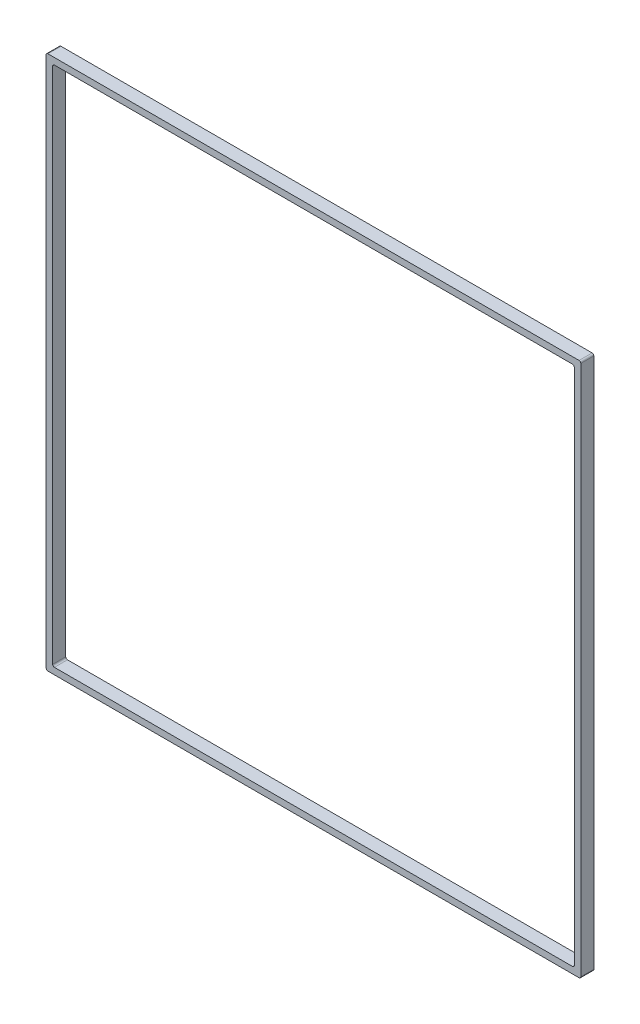
ISO-10303-21;
HEADER;
FILE_DESCRIPTION(('STEP AP214'),'2;1');
FILE_NAME('part.step','',(''),(''),'','','');
FILE_SCHEMA(('AUTOMOTIVE_DESIGN { 1 0 10303 214 1 1 1 1 }'));
ENDSEC;
DATA;
#1=APPLICATION_CONTEXT('core data for automotive mechanical design processes');
#2=APPLICATION_PROTOCOL_DEFINITION('international standard','automotive_design',2000,#1);
#3=PRODUCT_CONTEXT('',#1,'mechanical');
#4=PRODUCT('Part','Part','',(#3));
#5=PRODUCT_RELATED_PRODUCT_CATEGORY('part','',(#4));
#6=PRODUCT_DEFINITION_FORMATION('','',#4);
#7=PRODUCT_DEFINITION_CONTEXT('part definition',#1,'design');
#8=PRODUCT_DEFINITION('design','',#6,#7);
#9=PRODUCT_DEFINITION_SHAPE('','',#8);
#10=(LENGTH_UNIT() NAMED_UNIT(*) SI_UNIT(.MILLI.,.METRE.));
#11=(NAMED_UNIT(*) PLANE_ANGLE_UNIT() SI_UNIT($,.RADIAN.));
#12=(NAMED_UNIT(*) SI_UNIT($,.STERADIAN.) SOLID_ANGLE_UNIT());
#13=UNCERTAINTY_MEASURE_WITH_UNIT(LENGTH_MEASURE(1.E-05),#10,'distance_accuracy_value','');
#14=(GEOMETRIC_REPRESENTATION_CONTEXT(3) GLOBAL_UNCERTAINTY_ASSIGNED_CONTEXT((#13)) GLOBAL_UNIT_ASSIGNED_CONTEXT((#10,
#11,#12)) REPRESENTATION_CONTEXT('',''));
#15=CARTESIAN_POINT('',(0.,0.,0.));
#16=DIRECTION('',(0.,0.,1.));
#17=DIRECTION('',(1.,0.,0.));
#18=AXIS2_PLACEMENT_3D('',#15,#16,#17);
#19=CARTESIAN_POINT('',(390.525,390.525,19.05));
#20=DIRECTION('',(0.,0.,-1.));
#21=DIRECTION('',(-1.,0.,0.));
#22=AXIS2_PLACEMENT_3D('',#19,#20,#21);
#23=PLANE('',#22);
#24=DIRECTION('',(1.,0.,0.));
#25=VECTOR('',#24,1.);
#26=CARTESIAN_POINT('',(-390.525,-390.525,19.05));
#27=LINE('',#26,#25);
#28=CARTESIAN_POINT('',(-387.985,-390.525,19.05));
#29=VERTEX_POINT('',#28);
#30=CARTESIAN_POINT('',(387.985,-390.525,19.05));
#31=VERTEX_POINT('',#30);
#32=EDGE_CURVE('E172',#29,#31,#27,.T.);
#33=ORIENTED_EDGE('',*,*,#32,.T.);
#34=CARTESIAN_POINT('',(387.985,-387.985,19.05));
#35=DIRECTION('',(0.,0.,-1.));
#36=DIRECTION('',(-1.,0.,0.));
#37=AXIS2_PLACEMENT_3D('',#34,#35,#36);
#38=CIRCLE('',#37,2.54);
#39=CARTESIAN_POINT('',(390.525,-387.985,19.05));
#40=VERTEX_POINT('',#39);
#41=EDGE_CURVE('E219',#31,#40,#38,.F.);
#42=ORIENTED_EDGE('',*,*,#41,.T.);
#43=DIRECTION('',(0.,1.,0.));
#44=VECTOR('',#43,1.);
#45=CARTESIAN_POINT('',(390.525,-390.525,19.05));
#46=LINE('',#45,#44);
#47=CARTESIAN_POINT('',(390.525,387.985,19.05));
#48=VERTEX_POINT('',#47);
#49=EDGE_CURVE('E272',#40,#48,#46,.T.);
#50=ORIENTED_EDGE('',*,*,#49,.T.);
#51=CARTESIAN_POINT('',(387.985,387.985,19.05));
#52=DIRECTION('',(0.,0.,-1.));
#53=DIRECTION('',(-1.,0.,0.));
#54=AXIS2_PLACEMENT_3D('',#51,#52,#53);
#55=CIRCLE('',#54,2.54);
#56=CARTESIAN_POINT('',(387.985,390.525,19.05));
#57=VERTEX_POINT('',#56);
#58=EDGE_CURVE('E214',#48,#57,#55,.F.);
#59=ORIENTED_EDGE('',*,*,#58,.T.);
#60=DIRECTION('',(-1.,0.,0.));
#61=VECTOR('',#60,1.);
#62=CARTESIAN_POINT('',(-390.525,390.525,19.05));
#63=LINE('',#62,#61);
#64=CARTESIAN_POINT('',(-387.985,390.525,19.05));
#65=VERTEX_POINT('',#64);
#66=EDGE_CURVE('E275',#57,#65,#63,.T.);
#67=ORIENTED_EDGE('',*,*,#66,.T.);
#68=CARTESIAN_POINT('',(-387.985,387.985,19.05));
#69=DIRECTION('',(0.,0.,-1.));
#70=DIRECTION('',(-1.,0.,0.));
#71=AXIS2_PLACEMENT_3D('',#68,#69,#70);
#72=CIRCLE('',#71,2.54);
#73=CARTESIAN_POINT('',(-390.525,387.985,19.05));
#74=VERTEX_POINT('',#73);
#75=EDGE_CURVE('E54',#65,#74,#72,.F.);
#76=ORIENTED_EDGE('',*,*,#75,.T.);
#77=DIRECTION('',(0.,-1.,0.));
#78=VECTOR('',#77,1.);
#79=CARTESIAN_POINT('',(-390.525,-390.525,19.05));
#80=LINE('',#79,#78);
#81=CARTESIAN_POINT('',(-390.525,-387.985,19.05));
#82=VERTEX_POINT('',#81);
#83=EDGE_CURVE('E177',#74,#82,#80,.T.);
#84=ORIENTED_EDGE('',*,*,#83,.T.);
#85=CARTESIAN_POINT('',(-387.985,-387.985,19.05));
#86=DIRECTION('',(0.,0.,-1.));
#87=DIRECTION('',(-1.,0.,0.));
#88=AXIS2_PLACEMENT_3D('',#85,#86,#87);
#89=CIRCLE('',#88,2.54);
#90=EDGE_CURVE('E217',#82,#29,#89,.F.);
#91=ORIENTED_EDGE('',*,*,#90,.T.);
#92=EDGE_LOOP('',(#33,#42,#50,#59,#67,#76,#84,#91));
#93=FACE_BOUND('',#92,.T.);
#94=DIRECTION('',(0.,1.,0.));
#95=VECTOR('',#94,1.);
#96=CARTESIAN_POINT('',(381.,-381.,19.05));
#97=LINE('',#96,#95);
#98=CARTESIAN_POINT('',(381.,-378.46,19.05));
#99=VERTEX_POINT('',#98);
#100=CARTESIAN_POINT('',(381.,378.46,19.05));
#101=VERTEX_POINT('',#100);
#102=EDGE_CURVE('E261',#99,#101,#97,.T.);
#103=ORIENTED_EDGE('',*,*,#102,.F.);
#104=CARTESIAN_POINT('',(378.46,-378.46,19.05));
#105=DIRECTION('',(0.,0.,-1.));
#106=DIRECTION('',(-1.,0.,0.));
#107=AXIS2_PLACEMENT_3D('',#104,#105,#106);
#108=CIRCLE('',#107,2.54);
#109=CARTESIAN_POINT('',(378.46,-381.,19.05));
#110=VERTEX_POINT('',#109);
#111=EDGE_CURVE('E157',#99,#110,#108,.T.);
#112=ORIENTED_EDGE('',*,*,#111,.T.);
#113=DIRECTION('',(1.,0.,0.));
#114=VECTOR('',#113,1.);
#115=CARTESIAN_POINT('',(-381.,-381.,19.05));
#116=LINE('',#115,#114);
#117=CARTESIAN_POINT('',(-378.46,-381.,19.05));
#118=VERTEX_POINT('',#117);
#119=EDGE_CURVE('E263',#118,#110,#116,.T.);
#120=ORIENTED_EDGE('',*,*,#119,.F.);
#121=CARTESIAN_POINT('',(-378.46,-378.46,19.05));
#122=DIRECTION('',(0.,0.,-1.));
#123=DIRECTION('',(-1.,0.,0.));
#124=AXIS2_PLACEMENT_3D('',#121,#122,#123);
#125=CIRCLE('',#124,2.54);
#126=CARTESIAN_POINT('',(-381.,-378.46,19.05));
#127=VERTEX_POINT('',#126);
#128=EDGE_CURVE('E236',#118,#127,#125,.T.);
#129=ORIENTED_EDGE('',*,*,#128,.T.);
#130=DIRECTION('',(0.,-1.,0.));
#131=VECTOR('',#130,1.);
#132=CARTESIAN_POINT('',(-381.,-381.,19.05));
#133=LINE('',#132,#131);
#134=CARTESIAN_POINT('',(-381.,378.46,19.05));
#135=VERTEX_POINT('',#134);
#136=EDGE_CURVE('E257',#135,#127,#133,.T.);
#137=ORIENTED_EDGE('',*,*,#136,.F.);
#138=CARTESIAN_POINT('',(-378.46,378.46,19.05));
#139=DIRECTION('',(0.,0.,-1.));
#140=DIRECTION('',(-1.,0.,0.));
#141=AXIS2_PLACEMENT_3D('',#138,#139,#140);
#142=CIRCLE('',#141,2.54);
#143=CARTESIAN_POINT('',(-378.46,381.,19.05));
#144=VERTEX_POINT('',#143);
#145=EDGE_CURVE('E11',#135,#144,#142,.T.);
#146=ORIENTED_EDGE('',*,*,#145,.T.);
#147=DIRECTION('',(-1.,0.,0.));
#148=VECTOR('',#147,1.);
#149=CARTESIAN_POINT('',(-381.,381.,19.05));
#150=LINE('',#149,#148);
#151=CARTESIAN_POINT('',(378.46,381.,19.05));
#152=VERTEX_POINT('',#151);
#153=EDGE_CURVE('E255',#152,#144,#150,.T.);
#154=ORIENTED_EDGE('',*,*,#153,.F.);
#155=CARTESIAN_POINT('',(378.46,378.46,19.05));
#156=DIRECTION('',(0.,0.,-1.));
#157=DIRECTION('',(-1.,0.,0.));
#158=AXIS2_PLACEMENT_3D('',#155,#156,#157);
#159=CIRCLE('',#158,2.54);
#160=EDGE_CURVE('E158',#152,#101,#159,.T.);
#161=ORIENTED_EDGE('',*,*,#160,.T.);
#162=EDGE_LOOP('',(#103,#112,#120,#129,#137,#146,#154,#161));
#163=FACE_BOUND('',#162,.T.);
#164=ADVANCED_FACE('F32',(#93,#163),#23,.F.);
#165=CARTESIAN_POINT('',(390.525,390.525,0.));
#166=DIRECTION('',(0.,0.,-1.));
#167=DIRECTION('',(-1.,0.,0.));
#168=AXIS2_PLACEMENT_3D('',#165,#166,#167);
#169=PLANE('',#168);
#170=DIRECTION('',(0.,1.,0.));
#171=VECTOR('',#170,1.);
#172=CARTESIAN_POINT('',(390.525,-390.525,0.));
#173=LINE('',#172,#171);
#174=CARTESIAN_POINT('',(390.525,-387.985,0.));
#175=VERTEX_POINT('',#174);
#176=CARTESIAN_POINT('',(390.525,387.985,0.));
#177=VERTEX_POINT('',#176);
#178=EDGE_CURVE('E268',#175,#177,#173,.T.);
#179=ORIENTED_EDGE('',*,*,#178,.F.);
#180=CARTESIAN_POINT('',(387.985,-387.985,0.));
#181=DIRECTION('',(0.,0.,-1.));
#182=DIRECTION('',(-1.,0.,0.));
#183=AXIS2_PLACEMENT_3D('',#180,#181,#182);
#184=CIRCLE('',#183,2.54);
#185=CARTESIAN_POINT('',(387.985,-390.525,0.));
#186=VERTEX_POINT('',#185);
#187=EDGE_CURVE('E207',#175,#186,#184,.T.);
#188=ORIENTED_EDGE('',*,*,#187,.T.);
#189=DIRECTION('',(1.,0.,0.));
#190=VECTOR('',#189,1.);
#191=CARTESIAN_POINT('',(-390.525,-390.525,0.));
#192=LINE('',#191,#190);
#193=CARTESIAN_POINT('',(-387.985,-390.525,0.));
#194=VERTEX_POINT('',#193);
#195=EDGE_CURVE('E180',#194,#186,#192,.T.);
#196=ORIENTED_EDGE('',*,*,#195,.F.);
#197=CARTESIAN_POINT('',(-387.985,-387.985,0.));
#198=DIRECTION('',(0.,0.,-1.));
#199=DIRECTION('',(-1.,0.,0.));
#200=AXIS2_PLACEMENT_3D('',#197,#198,#199);
#201=CIRCLE('',#200,2.54);
#202=CARTESIAN_POINT('',(-390.525,-387.985,0.));
#203=VERTEX_POINT('',#202);
#204=EDGE_CURVE('E205',#194,#203,#201,.T.);
#205=ORIENTED_EDGE('',*,*,#204,.T.);
#206=DIRECTION('',(0.,-1.,0.));
#207=VECTOR('',#206,1.);
#208=CARTESIAN_POINT('',(-390.525,-390.525,0.));
#209=LINE('',#208,#207);
#210=CARTESIAN_POINT('',(-390.525,387.985,0.));
#211=VERTEX_POINT('',#210);
#212=EDGE_CURVE('E282',#211,#203,#209,.T.);
#213=ORIENTED_EDGE('',*,*,#212,.F.);
#214=CARTESIAN_POINT('',(-387.985,387.985,0.));
#215=DIRECTION('',(0.,0.,-1.));
#216=DIRECTION('',(-1.,0.,0.));
#217=AXIS2_PLACEMENT_3D('',#214,#215,#216);
#218=CIRCLE('',#217,2.54);
#219=CARTESIAN_POINT('',(-387.985,390.525,0.));
#220=VERTEX_POINT('',#219);
#221=EDGE_CURVE('E203',#211,#220,#218,.T.);
#222=ORIENTED_EDGE('',*,*,#221,.T.);
#223=DIRECTION('',(-1.,0.,0.));
#224=VECTOR('',#223,1.);
#225=CARTESIAN_POINT('',(-390.525,390.525,0.));
#226=LINE('',#225,#224);
#227=CARTESIAN_POINT('',(387.985,390.525,0.));
#228=VERTEX_POINT('',#227);
#229=EDGE_CURVE('E280',#228,#220,#226,.T.);
#230=ORIENTED_EDGE('',*,*,#229,.F.);
#231=CARTESIAN_POINT('',(387.985,387.985,0.));
#232=DIRECTION('',(0.,0.,-1.));
#233=DIRECTION('',(-1.,0.,0.));
#234=AXIS2_PLACEMENT_3D('',#231,#232,#233);
#235=CIRCLE('',#234,2.54);
#236=EDGE_CURVE('E201',#228,#177,#235,.T.);
#237=ORIENTED_EDGE('',*,*,#236,.T.);
#238=EDGE_LOOP('',(#179,#188,#196,#205,#213,#222,#230,#237));
#239=FACE_BOUND('',#238,.T.);
#240=DIRECTION('',(0.,-1.,0.));
#241=VECTOR('',#240,1.);
#242=CARTESIAN_POINT('',(-381.,-381.,0.));
#243=LINE('',#242,#241);
#244=CARTESIAN_POINT('',(-381.,378.46,0.));
#245=VERTEX_POINT('',#244);
#246=CARTESIAN_POINT('',(-381.,-378.46,0.));
#247=VERTEX_POINT('',#246);
#248=EDGE_CURVE('E239',#245,#247,#243,.T.);
#249=ORIENTED_EDGE('',*,*,#248,.T.);
#250=CARTESIAN_POINT('',(-378.46,-378.46,0.));
#251=DIRECTION('',(0.,0.,-1.));
#252=DIRECTION('',(-1.,0.,0.));
#253=AXIS2_PLACEMENT_3D('',#250,#251,#252);
#254=CIRCLE('',#253,2.54);
#255=CARTESIAN_POINT('',(-378.46,-381.,0.));
#256=VERTEX_POINT('',#255);
#257=EDGE_CURVE('E234',#247,#256,#254,.F.);
#258=ORIENTED_EDGE('',*,*,#257,.T.);
#259=DIRECTION('',(1.,0.,0.));
#260=VECTOR('',#259,1.);
#261=CARTESIAN_POINT('',(-381.,-381.,0.));
#262=LINE('',#261,#260);
#263=CARTESIAN_POINT('',(378.46,-381.,0.));
#264=VERTEX_POINT('',#263);
#265=EDGE_CURVE('E152',#256,#264,#262,.T.);
#266=ORIENTED_EDGE('',*,*,#265,.T.);
#267=CARTESIAN_POINT('',(378.46,-378.46,0.));
#268=DIRECTION('',(0.,0.,-1.));
#269=DIRECTION('',(-1.,0.,0.));
#270=AXIS2_PLACEMENT_3D('',#267,#268,#269);
#271=CIRCLE('',#270,2.54);
#272=CARTESIAN_POINT('',(381.,-378.46,0.));
#273=VERTEX_POINT('',#272);
#274=EDGE_CURVE('E146',#264,#273,#271,.F.);
#275=ORIENTED_EDGE('',*,*,#274,.T.);
#276=DIRECTION('',(0.,1.,0.));
#277=VECTOR('',#276,1.);
#278=CARTESIAN_POINT('',(381.,-381.,0.));
#279=LINE('',#278,#277);
#280=CARTESIAN_POINT('',(381.,378.46,0.));
#281=VERTEX_POINT('',#280);
#282=EDGE_CURVE('E150',#273,#281,#279,.T.);
#283=ORIENTED_EDGE('',*,*,#282,.T.);
#284=CARTESIAN_POINT('',(378.46,378.46,0.));
#285=DIRECTION('',(0.,0.,-1.));
#286=DIRECTION('',(-1.,0.,0.));
#287=AXIS2_PLACEMENT_3D('',#284,#285,#286);
#288=CIRCLE('',#287,2.54);
#289=CARTESIAN_POINT('',(378.46,381.,0.));
#290=VERTEX_POINT('',#289);
#291=EDGE_CURVE('E230',#281,#290,#288,.F.);
#292=ORIENTED_EDGE('',*,*,#291,.T.);
#293=DIRECTION('',(-1.,0.,0.));
#294=VECTOR('',#293,1.);
#295=CARTESIAN_POINT('',(-381.,381.,0.));
#296=LINE('',#295,#294);
#297=CARTESIAN_POINT('',(-378.46,381.,0.));
#298=VERTEX_POINT('',#297);
#299=EDGE_CURVE('E168',#290,#298,#296,.T.);
#300=ORIENTED_EDGE('',*,*,#299,.T.);
#301=CARTESIAN_POINT('',(-378.46,378.46,0.));
#302=DIRECTION('',(0.,0.,-1.));
#303=DIRECTION('',(-1.,0.,0.));
#304=AXIS2_PLACEMENT_3D('',#301,#302,#303);
#305=CIRCLE('',#304,2.54);
#306=EDGE_CURVE('E40',#298,#245,#305,.F.);
#307=ORIENTED_EDGE('',*,*,#306,.T.);
#308=EDGE_LOOP('',(#249,#258,#266,#275,#283,#292,#300,#307));
#309=FACE_BOUND('',#308,.T.);
#310=ADVANCED_FACE('F149',(#239,#309),#169,.T.);
#311=CARTESIAN_POINT('',(390.525,-390.525,19.05));
#312=DIRECTION('',(-1.,0.,0.));
#313=DIRECTION('',(0.,0.,1.));
#314=AXIS2_PLACEMENT_3D('',#311,#312,#313);
#315=PLANE('',#314);
#316=ORIENTED_EDGE('',*,*,#49,.F.);
#317=DIRECTION('',(0.,0.,-1.));
#318=VECTOR('',#317,1.);
#319=CARTESIAN_POINT('',(390.525,-387.985,19.05));
#320=LINE('',#319,#318);
#321=EDGE_CURVE('E198',#40,#175,#320,.T.);
#322=ORIENTED_EDGE('',*,*,#321,.T.);
#323=ORIENTED_EDGE('',*,*,#178,.T.);
#324=DIRECTION('',(0.,0.,-1.));
#325=VECTOR('',#324,1.);
#326=CARTESIAN_POINT('',(390.525,387.985,19.05));
#327=LINE('',#326,#325);
#328=EDGE_CURVE('E196',#177,#48,#327,.F.);
#329=ORIENTED_EDGE('',*,*,#328,.T.);
#330=EDGE_LOOP('',(#316,#322,#323,#329));
#331=FACE_BOUND('',#330,.T.);
#332=ADVANCED_FACE('F299',(#331),#315,.F.);
#333=CARTESIAN_POINT('',(-390.525,390.525,19.05));
#334=DIRECTION('',(0.,-1.,0.));
#335=DIRECTION('',(0.,0.,-1.));
#336=AXIS2_PLACEMENT_3D('',#333,#334,#335);
#337=PLANE('',#336);
#338=ORIENTED_EDGE('',*,*,#229,.T.);
#339=DIRECTION('',(0.,0.,-1.));
#340=VECTOR('',#339,1.);
#341=CARTESIAN_POINT('',(-387.985,390.525,19.05));
#342=LINE('',#341,#340);
#343=EDGE_CURVE('E228',#220,#65,#342,.F.);
#344=ORIENTED_EDGE('',*,*,#343,.T.);
#345=ORIENTED_EDGE('',*,*,#66,.F.);
#346=DIRECTION('',(0.,0.,-1.));
#347=VECTOR('',#346,1.);
#348=CARTESIAN_POINT('',(387.985,390.525,19.05));
#349=LINE('',#348,#347);
#350=EDGE_CURVE('E225',#57,#228,#349,.T.);
#351=ORIENTED_EDGE('',*,*,#350,.T.);
#352=EDGE_LOOP('',(#338,#344,#345,#351));
#353=FACE_BOUND('',#352,.T.);
#354=ADVANCED_FACE('F306',(#353),#337,.F.);
#355=CARTESIAN_POINT('',(-390.525,-390.525,19.05));
#356=DIRECTION('',(1.,0.,0.));
#357=DIRECTION('',(0.,0.,-1.));
#358=AXIS2_PLACEMENT_3D('',#355,#356,#357);
#359=PLANE('',#358);
#360=ORIENTED_EDGE('',*,*,#212,.T.);
#361=DIRECTION('',(0.,0.,-1.));
#362=VECTOR('',#361,1.);
#363=CARTESIAN_POINT('',(-390.525,-387.985,19.05));
#364=LINE('',#363,#362);
#365=EDGE_CURVE('E47',#203,#82,#364,.F.);
#366=ORIENTED_EDGE('',*,*,#365,.T.);
#367=ORIENTED_EDGE('',*,*,#83,.F.);
#368=DIRECTION('',(0.,0.,-1.));
#369=VECTOR('',#368,1.);
#370=CARTESIAN_POINT('',(-390.525,387.985,19.05));
#371=LINE('',#370,#369);
#372=EDGE_CURVE('E221',#74,#211,#371,.T.);
#373=ORIENTED_EDGE('',*,*,#372,.T.);
#374=EDGE_LOOP('',(#360,#366,#367,#373));
#375=FACE_BOUND('',#374,.T.);
#376=ADVANCED_FACE('F312',(#375),#359,.F.);
#377=CARTESIAN_POINT('',(-390.525,-390.525,19.05));
#378=DIRECTION('',(0.,1.,0.));
#379=DIRECTION('',(0.,0.,1.));
#380=AXIS2_PLACEMENT_3D('',#377,#378,#379);
#381=PLANE('',#380);
#382=ORIENTED_EDGE('',*,*,#195,.T.);
#383=DIRECTION('',(0.,0.,-1.));
#384=VECTOR('',#383,1.);
#385=CARTESIAN_POINT('',(387.985,-390.525,19.05));
#386=LINE('',#385,#384);
#387=EDGE_CURVE('E212',#186,#31,#386,.F.);
#388=ORIENTED_EDGE('',*,*,#387,.T.);
#389=ORIENTED_EDGE('',*,*,#32,.F.);
#390=DIRECTION('',(0.,0.,-1.));
#391=VECTOR('',#390,1.);
#392=CARTESIAN_POINT('',(-387.985,-390.525,19.05));
#393=LINE('',#392,#391);
#394=EDGE_CURVE('E209',#29,#194,#393,.T.);
#395=ORIENTED_EDGE('',*,*,#394,.T.);
#396=EDGE_LOOP('',(#382,#388,#389,#395));
#397=FACE_BOUND('',#396,.T.);
#398=ADVANCED_FACE('F288',(#397),#381,.F.);
#399=CARTESIAN_POINT('',(381.,-381.,19.05));
#400=DIRECTION('',(-1.,0.,0.));
#401=DIRECTION('',(0.,0.,1.));
#402=AXIS2_PLACEMENT_3D('',#399,#400,#401);
#403=PLANE('',#402);
#404=ORIENTED_EDGE('',*,*,#102,.T.);
#405=DIRECTION('',(0.,0.,-1.));
#406=VECTOR('',#405,1.);
#407=CARTESIAN_POINT('',(381.,378.46,0.));
#408=LINE('',#407,#406);
#409=EDGE_CURVE('E167',#101,#281,#408,.T.);
#410=ORIENTED_EDGE('',*,*,#409,.T.);
#411=ORIENTED_EDGE('',*,*,#282,.F.);
#412=DIRECTION('',(0.,0.,-1.));
#413=VECTOR('',#412,1.);
#414=CARTESIAN_POINT('',(381.,-378.46,19.05));
#415=LINE('',#414,#413);
#416=EDGE_CURVE('E164',#273,#99,#415,.F.);
#417=ORIENTED_EDGE('',*,*,#416,.T.);
#418=EDGE_LOOP('',(#404,#410,#411,#417));
#419=FACE_BOUND('',#418,.T.);
#420=ADVANCED_FACE('F163',(#419),#403,.T.);
#421=CARTESIAN_POINT('',(-381.,381.,19.05));
#422=DIRECTION('',(0.,-1.,0.));
#423=DIRECTION('',(0.,0.,-1.));
#424=AXIS2_PLACEMENT_3D('',#421,#422,#423);
#425=PLANE('',#424);
#426=ORIENTED_EDGE('',*,*,#299,.F.);
#427=DIRECTION('',(0.,0.,-1.));
#428=VECTOR('',#427,1.);
#429=CARTESIAN_POINT('',(378.46,381.,19.05));
#430=LINE('',#429,#428);
#431=EDGE_CURVE('E185',#290,#152,#430,.F.);
#432=ORIENTED_EDGE('',*,*,#431,.T.);
#433=ORIENTED_EDGE('',*,*,#153,.T.);
#434=DIRECTION('',(0.,0.,-1.));
#435=VECTOR('',#434,1.);
#436=CARTESIAN_POINT('',(-378.46,381.,0.));
#437=LINE('',#436,#435);
#438=EDGE_CURVE('E174',#144,#298,#437,.T.);
#439=ORIENTED_EDGE('',*,*,#438,.T.);
#440=EDGE_LOOP('',(#426,#432,#433,#439));
#441=FACE_BOUND('',#440,.T.);
#442=ADVANCED_FACE('F259',(#441),#425,.T.);
#443=CARTESIAN_POINT('',(-381.,-381.,19.05));
#444=DIRECTION('',(1.,0.,0.));
#445=DIRECTION('',(0.,0.,-1.));
#446=AXIS2_PLACEMENT_3D('',#443,#444,#445);
#447=PLANE('',#446);
#448=ORIENTED_EDGE('',*,*,#136,.T.);
#449=DIRECTION('',(0.,0.,-1.));
#450=VECTOR('',#449,1.);
#451=CARTESIAN_POINT('',(-381.,-378.46,0.));
#452=LINE('',#451,#450);
#453=EDGE_CURVE('E193',#127,#247,#452,.T.);
#454=ORIENTED_EDGE('',*,*,#453,.T.);
#455=ORIENTED_EDGE('',*,*,#248,.F.);
#456=DIRECTION('',(0.,0.,-1.));
#457=VECTOR('',#456,1.);
#458=CARTESIAN_POINT('',(-381.,378.46,19.05));
#459=LINE('',#458,#457);
#460=EDGE_CURVE('E191',#245,#135,#459,.F.);
#461=ORIENTED_EDGE('',*,*,#460,.T.);
#462=EDGE_LOOP('',(#448,#454,#455,#461));
#463=FACE_BOUND('',#462,.T.);
#464=ADVANCED_FACE('F246',(#463),#447,.T.);
#465=CARTESIAN_POINT('',(-381.,-381.,19.05));
#466=DIRECTION('',(0.,1.,0.));
#467=DIRECTION('',(0.,0.,1.));
#468=AXIS2_PLACEMENT_3D('',#465,#466,#467);
#469=PLANE('',#468);
#470=ORIENTED_EDGE('',*,*,#119,.T.);
#471=DIRECTION('',(0.,0.,-1.));
#472=VECTOR('',#471,1.);
#473=CARTESIAN_POINT('',(378.46,-381.,0.));
#474=LINE('',#473,#472);
#475=EDGE_CURVE('E189',#110,#264,#474,.T.);
#476=ORIENTED_EDGE('',*,*,#475,.T.);
#477=ORIENTED_EDGE('',*,*,#265,.F.);
#478=DIRECTION('',(0.,0.,-1.));
#479=VECTOR('',#478,1.);
#480=CARTESIAN_POINT('',(-378.46,-381.,19.05));
#481=LINE('',#480,#479);
#482=EDGE_CURVE('E187',#256,#118,#481,.F.);
#483=ORIENTED_EDGE('',*,*,#482,.T.);
#484=EDGE_LOOP('',(#470,#476,#477,#483));
#485=FACE_BOUND('',#484,.T.);
#486=ADVANCED_FACE('F343',(#485),#469,.T.);
#487=CARTESIAN_POINT('',(378.46,378.46,19.05));
#488=DIRECTION('',(0.,0.,1.));
#489=DIRECTION('',(1.,0.,0.));
#490=AXIS2_PLACEMENT_3D('',#487,#488,#489);
#491=CYLINDRICAL_SURFACE('',#490,2.54);
#492=ORIENTED_EDGE('',*,*,#160,.F.);
#493=ORIENTED_EDGE('',*,*,#431,.F.);
#494=ORIENTED_EDGE('',*,*,#291,.F.);
#495=ORIENTED_EDGE('',*,*,#409,.F.);
#496=EDGE_LOOP('',(#492,#493,#494,#495));
#497=FACE_BOUND('',#496,.T.);
#498=ADVANCED_FACE('F340',(#497),#491,.F.);
#499=CARTESIAN_POINT('',(378.46,-378.46,19.05));
#500=DIRECTION('',(0.,0.,1.));
#501=DIRECTION('',(1.,0.,0.));
#502=AXIS2_PLACEMENT_3D('',#499,#500,#501);
#503=CYLINDRICAL_SURFACE('',#502,2.54);
#504=ORIENTED_EDGE('',*,*,#111,.F.);
#505=ORIENTED_EDGE('',*,*,#416,.F.);
#506=ORIENTED_EDGE('',*,*,#274,.F.);
#507=ORIENTED_EDGE('',*,*,#475,.F.);
#508=EDGE_LOOP('',(#504,#505,#506,#507));
#509=FACE_BOUND('',#508,.T.);
#510=ADVANCED_FACE('F171',(#509),#503,.F.);
#511=CARTESIAN_POINT('',(-378.46,-378.46,19.05));
#512=DIRECTION('',(0.,0.,1.));
#513=DIRECTION('',(1.,0.,0.));
#514=AXIS2_PLACEMENT_3D('',#511,#512,#513);
#515=CYLINDRICAL_SURFACE('',#514,2.54);
#516=ORIENTED_EDGE('',*,*,#128,.F.);
#517=ORIENTED_EDGE('',*,*,#482,.F.);
#518=ORIENTED_EDGE('',*,*,#257,.F.);
#519=ORIENTED_EDGE('',*,*,#453,.F.);
#520=EDGE_LOOP('',(#516,#517,#518,#519));
#521=FACE_BOUND('',#520,.T.);
#522=ADVANCED_FACE('F347',(#521),#515,.F.);
#523=CARTESIAN_POINT('',(-378.46,378.46,19.05));
#524=DIRECTION('',(0.,0.,1.));
#525=DIRECTION('',(1.,0.,0.));
#526=AXIS2_PLACEMENT_3D('',#523,#524,#525);
#527=CYLINDRICAL_SURFACE('',#526,2.54);
#528=ORIENTED_EDGE('',*,*,#145,.F.);
#529=ORIENTED_EDGE('',*,*,#460,.F.);
#530=ORIENTED_EDGE('',*,*,#306,.F.);
#531=ORIENTED_EDGE('',*,*,#438,.F.);
#532=EDGE_LOOP('',(#528,#529,#530,#531));
#533=FACE_BOUND('',#532,.T.);
#534=ADVANCED_FACE('F251',(#533),#527,.F.);
#535=CARTESIAN_POINT('',(387.985,-387.985,19.05));
#536=DIRECTION('',(0.,0.,-1.));
#537=DIRECTION('',(-1.,0.,0.));
#538=AXIS2_PLACEMENT_3D('',#535,#536,#537);
#539=CYLINDRICAL_SURFACE('',#538,2.54);
#540=ORIENTED_EDGE('',*,*,#41,.F.);
#541=ORIENTED_EDGE('',*,*,#387,.F.);
#542=ORIENTED_EDGE('',*,*,#187,.F.);
#543=ORIENTED_EDGE('',*,*,#321,.F.);
#544=EDGE_LOOP('',(#540,#541,#542,#543));
#545=FACE_BOUND('',#544,.T.);
#546=ADVANCED_FACE('F294',(#545),#539,.T.);
#547=CARTESIAN_POINT('',(-387.985,-387.985,19.05));
#548=DIRECTION('',(0.,0.,-1.));
#549=DIRECTION('',(-1.,0.,0.));
#550=AXIS2_PLACEMENT_3D('',#547,#548,#549);
#551=CYLINDRICAL_SURFACE('',#550,2.54);
#552=ORIENTED_EDGE('',*,*,#90,.F.);
#553=ORIENTED_EDGE('',*,*,#365,.F.);
#554=ORIENTED_EDGE('',*,*,#204,.F.);
#555=ORIENTED_EDGE('',*,*,#394,.F.);
#556=EDGE_LOOP('',(#552,#553,#554,#555));
#557=FACE_BOUND('',#556,.T.);
#558=ADVANCED_FACE('F315',(#557),#551,.T.);
#559=CARTESIAN_POINT('',(-387.985,387.985,19.05));
#560=DIRECTION('',(0.,0.,-1.));
#561=DIRECTION('',(-1.,0.,0.));
#562=AXIS2_PLACEMENT_3D('',#559,#560,#561);
#563=CYLINDRICAL_SURFACE('',#562,2.54);
#564=ORIENTED_EDGE('',*,*,#75,.F.);
#565=ORIENTED_EDGE('',*,*,#343,.F.);
#566=ORIENTED_EDGE('',*,*,#221,.F.);
#567=ORIENTED_EDGE('',*,*,#372,.F.);
#568=EDGE_LOOP('',(#564,#565,#566,#567));
#569=FACE_BOUND('',#568,.T.);
#570=ADVANCED_FACE('F310',(#569),#563,.T.);
#571=CARTESIAN_POINT('',(387.985,387.985,19.05));
#572=DIRECTION('',(0.,0.,-1.));
#573=DIRECTION('',(-1.,0.,0.));
#574=AXIS2_PLACEMENT_3D('',#571,#572,#573);
#575=CYLINDRICAL_SURFACE('',#574,2.54);
#576=ORIENTED_EDGE('',*,*,#58,.F.);
#577=ORIENTED_EDGE('',*,*,#328,.F.);
#578=ORIENTED_EDGE('',*,*,#236,.F.);
#579=ORIENTED_EDGE('',*,*,#350,.F.);
#580=EDGE_LOOP('',(#576,#577,#578,#579));
#581=FACE_BOUND('',#580,.T.);
#582=ADVANCED_FACE('F34',(#581),#575,.T.);
#583=CLOSED_SHELL('',(#164,#310,#332,#354,#376,#398,#420,#442,#464,#486,#498,#510,#522,#534,
#546,#558,#570,#582));
#584=MANIFOLD_SOLID_BREP('B2',#583);
#585=ADVANCED_BREP_SHAPE_REPRESENTATION('',(#18,#584),#14);
#586=SHAPE_DEFINITION_REPRESENTATION(#9,#585);
ENDSEC;
END-ISO-10303-21;
